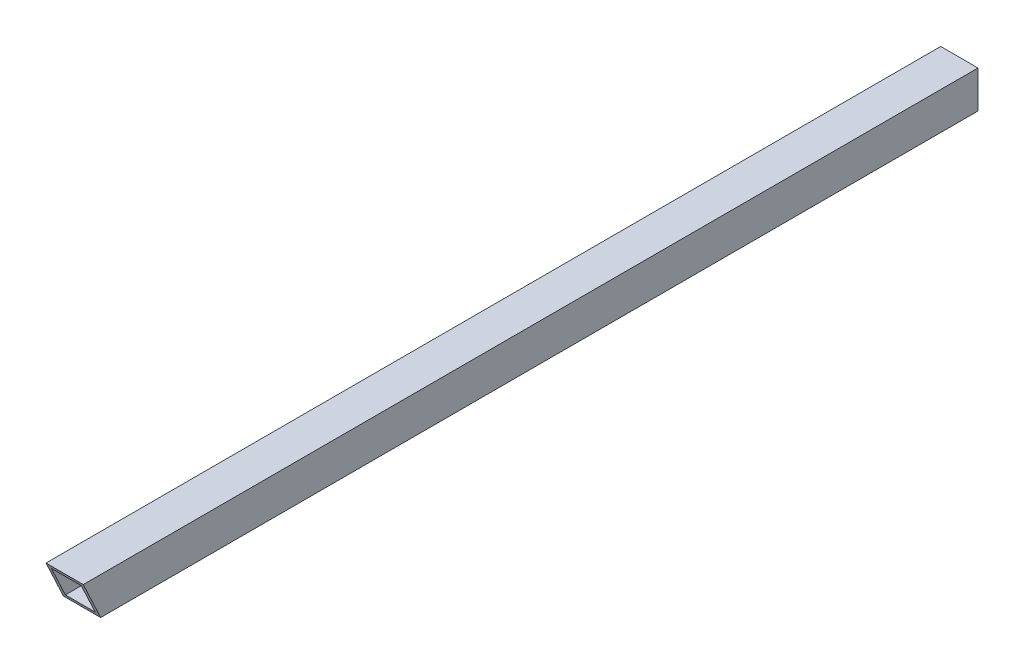
ISO-10303-21;
HEADER;
FILE_DESCRIPTION(('STEP AP214'),'2;1');
FILE_NAME('part.step','',(''),(''),'','','');
FILE_SCHEMA(('AUTOMOTIVE_DESIGN { 1 0 10303 214 1 1 1 1 }'));
ENDSEC;
DATA;
#1=APPLICATION_CONTEXT('core data for automotive mechanical design processes');
#2=APPLICATION_PROTOCOL_DEFINITION('international standard','automotive_design',2000,#1);
#3=PRODUCT_CONTEXT('',#1,'mechanical');
#4=PRODUCT('Part','Part','',(#3));
#5=PRODUCT_RELATED_PRODUCT_CATEGORY('part','',(#4));
#6=PRODUCT_DEFINITION_FORMATION('','',#4);
#7=PRODUCT_DEFINITION_CONTEXT('part definition',#1,'design');
#8=PRODUCT_DEFINITION('design','',#6,#7);
#9=PRODUCT_DEFINITION_SHAPE('','',#8);
#10=(LENGTH_UNIT() NAMED_UNIT(*) SI_UNIT(.MILLI.,.METRE.));
#11=(NAMED_UNIT(*) PLANE_ANGLE_UNIT() SI_UNIT($,.RADIAN.));
#12=(NAMED_UNIT(*) SI_UNIT($,.STERADIAN.) SOLID_ANGLE_UNIT());
#13=UNCERTAINTY_MEASURE_WITH_UNIT(LENGTH_MEASURE(1.E-05),#10,'distance_accuracy_value','');
#14=(GEOMETRIC_REPRESENTATION_CONTEXT(3) GLOBAL_UNCERTAINTY_ASSIGNED_CONTEXT((#13)) GLOBAL_UNIT_ASSIGNED_CONTEXT((#10,
#11,#12)) REPRESENTATION_CONTEXT('',''));
#15=CARTESIAN_POINT('',(0.,0.,0.));
#16=DIRECTION('',(0.,0.,1.));
#17=DIRECTION('',(1.,0.,0.));
#18=AXIS2_PLACEMENT_3D('',#15,#16,#17);
#19=CARTESIAN_POINT('',(0.,0.,0.));
#20=DIRECTION('',(0.,0.,1.));
#21=DIRECTION('',(1.,0.,0.));
#22=AXIS2_PLACEMENT_3D('',#19,#20,#21);
#23=PLANE('',#22);
#24=DIRECTION('',(0.,-1.,0.));
#25=VECTOR('',#24,1.);
#26=CARTESIAN_POINT('',(-9.525,-9.525,0.));
#27=LINE('',#26,#25);
#28=CARTESIAN_POINT('',(-9.525,9.525,0.));
#29=VERTEX_POINT('',#28);
#30=CARTESIAN_POINT('',(-9.525,-9.525,0.));
#31=VERTEX_POINT('',#30);
#32=EDGE_CURVE('E123',#29,#31,#27,.T.);
#33=ORIENTED_EDGE('',*,*,#32,.F.);
#34=DIRECTION('',(-1.,0.,0.));
#35=VECTOR('',#34,1.);
#36=CARTESIAN_POINT('',(9.525,9.525,0.));
#37=LINE('',#36,#35);
#38=CARTESIAN_POINT('',(9.525,9.525,0.));
#39=VERTEX_POINT('',#38);
#40=EDGE_CURVE('E131',#39,#29,#37,.T.);
#41=ORIENTED_EDGE('',*,*,#40,.F.);
#42=DIRECTION('',(0.,1.,0.));
#43=VECTOR('',#42,1.);
#44=CARTESIAN_POINT('',(9.525,-9.525,0.));
#45=LINE('',#44,#43);
#46=CARTESIAN_POINT('',(9.525,-9.525,0.));
#47=VERTEX_POINT('',#46);
#48=EDGE_CURVE('E133',#47,#39,#45,.T.);
#49=ORIENTED_EDGE('',*,*,#48,.F.);
#50=DIRECTION('',(1.,0.,0.));
#51=VECTOR('',#50,1.);
#52=CARTESIAN_POINT('',(9.525,-9.525,0.));
#53=LINE('',#52,#51);
#54=EDGE_CURVE('E135',#31,#47,#53,.T.);
#55=ORIENTED_EDGE('',*,*,#54,.F.);
#56=EDGE_LOOP('',(#33,#41,#49,#55));
#57=FACE_BOUND('',#56,.T.);
#58=DIRECTION('',(0.,-1.,0.));
#59=VECTOR('',#58,1.);
#60=CARTESIAN_POINT('',(-7.62,-7.62,0.));
#61=LINE('',#60,#59);
#62=CARTESIAN_POINT('',(-7.62,7.61999999999999,0.));
#63=VERTEX_POINT('',#62);
#64=CARTESIAN_POINT('',(-7.62,-7.62,0.));
#65=VERTEX_POINT('',#64);
#66=EDGE_CURVE('E155',#63,#65,#61,.T.);
#67=ORIENTED_EDGE('',*,*,#66,.T.);
#68=DIRECTION('',(1.,0.,0.));
#69=VECTOR('',#68,1.);
#70=CARTESIAN_POINT('',(7.61999999999999,-7.62,0.));
#71=LINE('',#70,#69);
#72=CARTESIAN_POINT('',(7.61999999999999,-7.62,0.));
#73=VERTEX_POINT('',#72);
#74=EDGE_CURVE('E152',#65,#73,#71,.T.);
#75=ORIENTED_EDGE('',*,*,#74,.T.);
#76=DIRECTION('',(0.,1.,0.));
#77=VECTOR('',#76,1.);
#78=CARTESIAN_POINT('',(7.61999999999999,-7.62,0.));
#79=LINE('',#78,#77);
#80=CARTESIAN_POINT('',(7.61999999999999,7.61999999999999,0.));
#81=VERTEX_POINT('',#80);
#82=EDGE_CURVE('E149',#73,#81,#79,.T.);
#83=ORIENTED_EDGE('',*,*,#82,.T.);
#84=DIRECTION('',(-1.,0.,0.));
#85=VECTOR('',#84,1.);
#86=CARTESIAN_POINT('',(7.61999999999999,7.61999999999999,0.));
#87=LINE('',#86,#85);
#88=EDGE_CURVE('E146',#81,#63,#87,.T.);
#89=ORIENTED_EDGE('',*,*,#88,.T.);
#90=EDGE_LOOP('',(#67,#75,#83,#89));
#91=FACE_BOUND('',#90,.T.);
#92=ADVANCED_FACE('F36',(#57,#91),#23,.F.);
#93=CARTESIAN_POINT('',(-9.525,-9.525,457.2));
#94=DIRECTION('',(1.,0.,0.));
#95=DIRECTION('',(0.,0.,-1.));
#96=AXIS2_PLACEMENT_3D('',#93,#94,#95);
#97=PLANE('',#96);
#98=DIRECTION('',(0.,0.,-1.));
#99=VECTOR('',#98,1.);
#100=CARTESIAN_POINT('',(-9.525,-9.525,457.2));
#101=LINE('',#100,#99);
#102=CARTESIAN_POINT('',(-9.525,-9.525,448.316839112147));
#103=VERTEX_POINT('',#102);
#104=EDGE_CURVE('E44',#103,#31,#101,.T.);
#105=ORIENTED_EDGE('',*,*,#104,.F.);
#106=DIRECTION('',(0.,0.906307787036653,0.422618261740694));
#107=VECTOR('',#106,1.);
#108=CARTESIAN_POINT('',(-9.525,9.525,457.2));
#109=LINE('',#108,#107);
#110=CARTESIAN_POINT('',(-9.525,9.525,457.2));
#111=VERTEX_POINT('',#110);
#112=EDGE_CURVE('E100',#103,#111,#109,.T.);
#113=ORIENTED_EDGE('',*,*,#112,.T.);
#114=DIRECTION('',(0.,0.,-1.));
#115=VECTOR('',#114,1.);
#116=CARTESIAN_POINT('',(-9.525,9.525,457.2));
#117=LINE('',#116,#115);
#118=EDGE_CURVE('E129',#111,#29,#117,.T.);
#119=ORIENTED_EDGE('',*,*,#118,.T.);
#120=ORIENTED_EDGE('',*,*,#32,.T.);
#121=EDGE_LOOP('',(#105,#113,#119,#120));
#122=FACE_BOUND('',#121,.T.);
#123=ADVANCED_FACE('F38',(#122),#97,.F.);
#124=CARTESIAN_POINT('',(9.525,-9.525,457.2));
#125=DIRECTION('',(0.,1.,0.));
#126=DIRECTION('',(-1.,0.,0.));
#127=AXIS2_PLACEMENT_3D('',#124,#125,#126);
#128=PLANE('',#127);
#129=DIRECTION('',(0.,0.,-1.));
#130=VECTOR('',#129,1.);
#131=CARTESIAN_POINT('',(9.525,-9.525,457.2));
#132=LINE('',#131,#130);
#133=CARTESIAN_POINT('',(9.525,-9.525,448.316839112147));
#134=VERTEX_POINT('',#133);
#135=EDGE_CURVE('E118',#134,#47,#132,.T.);
#136=ORIENTED_EDGE('',*,*,#135,.F.);
#137=DIRECTION('',(1.,0.,0.));
#138=VECTOR('',#137,1.);
#139=CARTESIAN_POINT('',(-9.525,-9.525,448.316839112147));
#140=LINE('',#139,#138);
#141=EDGE_CURVE('E103',#103,#134,#140,.T.);
#142=ORIENTED_EDGE('',*,*,#141,.F.);
#143=ORIENTED_EDGE('',*,*,#104,.T.);
#144=ORIENTED_EDGE('',*,*,#54,.T.);
#145=EDGE_LOOP('',(#136,#142,#143,#144));
#146=FACE_BOUND('',#145,.T.);
#147=ADVANCED_FACE('F115',(#146),#128,.F.);
#148=CARTESIAN_POINT('',(9.525,-9.525,457.2));
#149=DIRECTION('',(-1.,0.,0.));
#150=DIRECTION('',(0.,0.,1.));
#151=AXIS2_PLACEMENT_3D('',#148,#149,#150);
#152=PLANE('',#151);
#153=DIRECTION('',(0.,0.,-1.));
#154=VECTOR('',#153,1.);
#155=CARTESIAN_POINT('',(9.525,9.525,457.2));
#156=LINE('',#155,#154);
#157=CARTESIAN_POINT('',(9.525,9.525,457.2));
#158=VERTEX_POINT('',#157);
#159=EDGE_CURVE('E124',#158,#39,#156,.T.);
#160=ORIENTED_EDGE('',*,*,#159,.F.);
#161=DIRECTION('',(0.,0.906307787036653,0.422618261740694));
#162=VECTOR('',#161,1.);
#163=CARTESIAN_POINT('',(9.525,9.525,457.2));
#164=LINE('',#163,#162);
#165=EDGE_CURVE('E111',#134,#158,#164,.T.);
#166=ORIENTED_EDGE('',*,*,#165,.F.);
#167=ORIENTED_EDGE('',*,*,#135,.T.);
#168=ORIENTED_EDGE('',*,*,#48,.T.);
#169=EDGE_LOOP('',(#160,#166,#167,#168));
#170=FACE_BOUND('',#169,.T.);
#171=ADVANCED_FACE('F164',(#170),#152,.F.);
#172=CARTESIAN_POINT('',(9.525,9.525,457.2));
#173=DIRECTION('',(0.,-1.,0.));
#174=DIRECTION('',(1.,0.,0.));
#175=AXIS2_PLACEMENT_3D('',#172,#173,#174);
#176=PLANE('',#175);
#177=ORIENTED_EDGE('',*,*,#40,.T.);
#178=ORIENTED_EDGE('',*,*,#118,.F.);
#179=DIRECTION('',(-1.,0.,0.));
#180=VECTOR('',#179,1.);
#181=CARTESIAN_POINT('',(9.525,9.525,457.2));
#182=LINE('',#181,#180);
#183=EDGE_CURVE('E106',#158,#111,#182,.T.);
#184=ORIENTED_EDGE('',*,*,#183,.F.);
#185=ORIENTED_EDGE('',*,*,#159,.T.);
#186=EDGE_LOOP('',(#177,#178,#184,#185));
#187=FACE_BOUND('',#186,.T.);
#188=ADVANCED_FACE('F168',(#187),#176,.F.);
#189=CARTESIAN_POINT('',(-7.62,-7.62,457.2));
#190=DIRECTION('',(1.,0.,0.));
#191=DIRECTION('',(0.,0.,-1.));
#192=AXIS2_PLACEMENT_3D('',#189,#190,#191);
#193=PLANE('',#192);
#194=DIRECTION('',(0.,0.906307787036653,0.422618261740694));
#195=VECTOR('',#194,1.);
#196=CARTESIAN_POINT('',(-7.62,-4.55779678403794,450.633084011363));
#197=LINE('',#196,#195);
#198=CARTESIAN_POINT('',(-7.62,-7.62,449.205155200933));
#199=VERTEX_POINT('',#198);
#200=CARTESIAN_POINT('',(-7.62,7.61999999999999,456.311683911215));
#201=VERTEX_POINT('',#200);
#202=EDGE_CURVE('E50',#199,#201,#197,.T.);
#203=ORIENTED_EDGE('',*,*,#202,.F.);
#204=DIRECTION('',(0.,0.,-1.));
#205=VECTOR('',#204,1.);
#206=CARTESIAN_POINT('',(-7.62,-7.62,457.2));
#207=LINE('',#206,#205);
#208=EDGE_CURVE('E138',#199,#65,#207,.T.);
#209=ORIENTED_EDGE('',*,*,#208,.T.);
#210=ORIENTED_EDGE('',*,*,#66,.F.);
#211=DIRECTION('',(0.,0.,-1.));
#212=VECTOR('',#211,1.);
#213=CARTESIAN_POINT('',(-7.62,7.61999999999999,457.2));
#214=LINE('',#213,#212);
#215=EDGE_CURVE('E57',#201,#63,#214,.T.);
#216=ORIENTED_EDGE('',*,*,#215,.F.);
#217=EDGE_LOOP('',(#203,#209,#210,#216));
#218=FACE_BOUND('',#217,.T.);
#219=ADVANCED_FACE('F175',(#218),#193,.T.);
#220=CARTESIAN_POINT('',(7.61999999999999,-7.62,457.2));
#221=DIRECTION('',(0.,1.,0.));
#222=DIRECTION('',(0.,0.,1.));
#223=AXIS2_PLACEMENT_3D('',#220,#221,#222);
#224=PLANE('',#223);
#225=DIRECTION('',(-1.,0.,0.));
#226=VECTOR('',#225,1.);
#227=CARTESIAN_POINT('',(7.61999999999999,-7.62,449.205155200933));
#228=LINE('',#227,#226);
#229=CARTESIAN_POINT('',(7.61999999999999,-7.62,449.205155200933));
#230=VERTEX_POINT('',#229);
#231=EDGE_CURVE('E159',#230,#199,#228,.T.);
#232=ORIENTED_EDGE('',*,*,#231,.F.);
#233=DIRECTION('',(0.,0.,-1.));
#234=VECTOR('',#233,1.);
#235=CARTESIAN_POINT('',(7.61999999999999,-7.62,457.2));
#236=LINE('',#235,#234);
#237=EDGE_CURVE('E141',#230,#73,#236,.T.);
#238=ORIENTED_EDGE('',*,*,#237,.T.);
#239=ORIENTED_EDGE('',*,*,#74,.F.);
#240=ORIENTED_EDGE('',*,*,#208,.F.);
#241=EDGE_LOOP('',(#232,#238,#239,#240));
#242=FACE_BOUND('',#241,.T.);
#243=ADVANCED_FACE('F179',(#242),#224,.T.);
#244=CARTESIAN_POINT('',(7.61999999999999,-7.62,457.2));
#245=DIRECTION('',(-1.,0.,0.));
#246=DIRECTION('',(0.,0.,1.));
#247=AXIS2_PLACEMENT_3D('',#244,#245,#246);
#248=PLANE('',#247);
#249=DIRECTION('',(0.,-0.906307787036653,-0.422618261740694));
#250=VECTOR('',#249,1.);
#251=CARTESIAN_POINT('',(7.61999999999999,-4.55779678403794,450.633084011363));
#252=LINE('',#251,#250);
#253=CARTESIAN_POINT('',(7.61999999999999,7.61999999999999,456.311683911215));
#254=VERTEX_POINT('',#253);
#255=EDGE_CURVE('E119',#254,#230,#252,.T.);
#256=ORIENTED_EDGE('',*,*,#255,.F.);
#257=DIRECTION('',(0.,0.,-1.));
#258=VECTOR('',#257,1.);
#259=CARTESIAN_POINT('',(7.61999999999999,7.61999999999999,457.2));
#260=LINE('',#259,#258);
#261=EDGE_CURVE('E143',#254,#81,#260,.T.);
#262=ORIENTED_EDGE('',*,*,#261,.T.);
#263=ORIENTED_EDGE('',*,*,#82,.F.);
#264=ORIENTED_EDGE('',*,*,#237,.F.);
#265=EDGE_LOOP('',(#256,#262,#263,#264));
#266=FACE_BOUND('',#265,.T.);
#267=ADVANCED_FACE('F184',(#266),#248,.T.);
#268=CARTESIAN_POINT('',(7.61999999999999,7.61999999999999,457.2));
#269=DIRECTION('',(0.,-1.,0.));
#270=DIRECTION('',(0.,0.,-1.));
#271=AXIS2_PLACEMENT_3D('',#268,#269,#270);
#272=PLANE('',#271);
#273=DIRECTION('',(1.,0.,0.));
#274=VECTOR('',#273,1.);
#275=CARTESIAN_POINT('',(7.61999999999999,7.61999999999999,456.311683911215));
#276=LINE('',#275,#274);
#277=EDGE_CURVE('E11',#201,#254,#276,.T.);
#278=ORIENTED_EDGE('',*,*,#277,.F.);
#279=ORIENTED_EDGE('',*,*,#215,.T.);
#280=ORIENTED_EDGE('',*,*,#88,.F.);
#281=ORIENTED_EDGE('',*,*,#261,.F.);
#282=EDGE_LOOP('',(#278,#279,#280,#281));
#283=FACE_BOUND('',#282,.T.);
#284=ADVANCED_FACE('F186',(#283),#272,.T.);
#285=CARTESIAN_POINT('',(-9.525,9.525,457.2));
#286=DIRECTION('',(0.,0.422618261740693,-0.906307787036653));
#287=DIRECTION('',(0.,0.906307787036653,0.422618261740694));
#288=AXIS2_PLACEMENT_3D('',#285,#286,#287);
#289=PLANE('',#288);
#290=ORIENTED_EDGE('',*,*,#202,.T.);
#291=ORIENTED_EDGE('',*,*,#277,.T.);
#292=ORIENTED_EDGE('',*,*,#255,.T.);
#293=ORIENTED_EDGE('',*,*,#231,.T.);
#294=EDGE_LOOP('',(#290,#291,#292,#293));
#295=FACE_BOUND('',#294,.T.);
#296=ORIENTED_EDGE('',*,*,#165,.T.);
#297=ORIENTED_EDGE('',*,*,#183,.T.);
#298=ORIENTED_EDGE('',*,*,#112,.F.);
#299=ORIENTED_EDGE('',*,*,#141,.T.);
#300=EDGE_LOOP('',(#296,#297,#298,#299));
#301=FACE_BOUND('',#300,.T.);
#302=ADVANCED_FACE('F102',(#295,#301),#289,.F.);
#303=CLOSED_SHELL('',(#92,#123,#147,#171,#188,#219,#243,#267,#284,#302));
#304=MANIFOLD_SOLID_BREP('B2',#303);
#305=ADVANCED_BREP_SHAPE_REPRESENTATION('',(#18,#304),#14);
#306=SHAPE_DEFINITION_REPRESENTATION(#9,#305);
ENDSEC;
END-ISO-10303-21;
